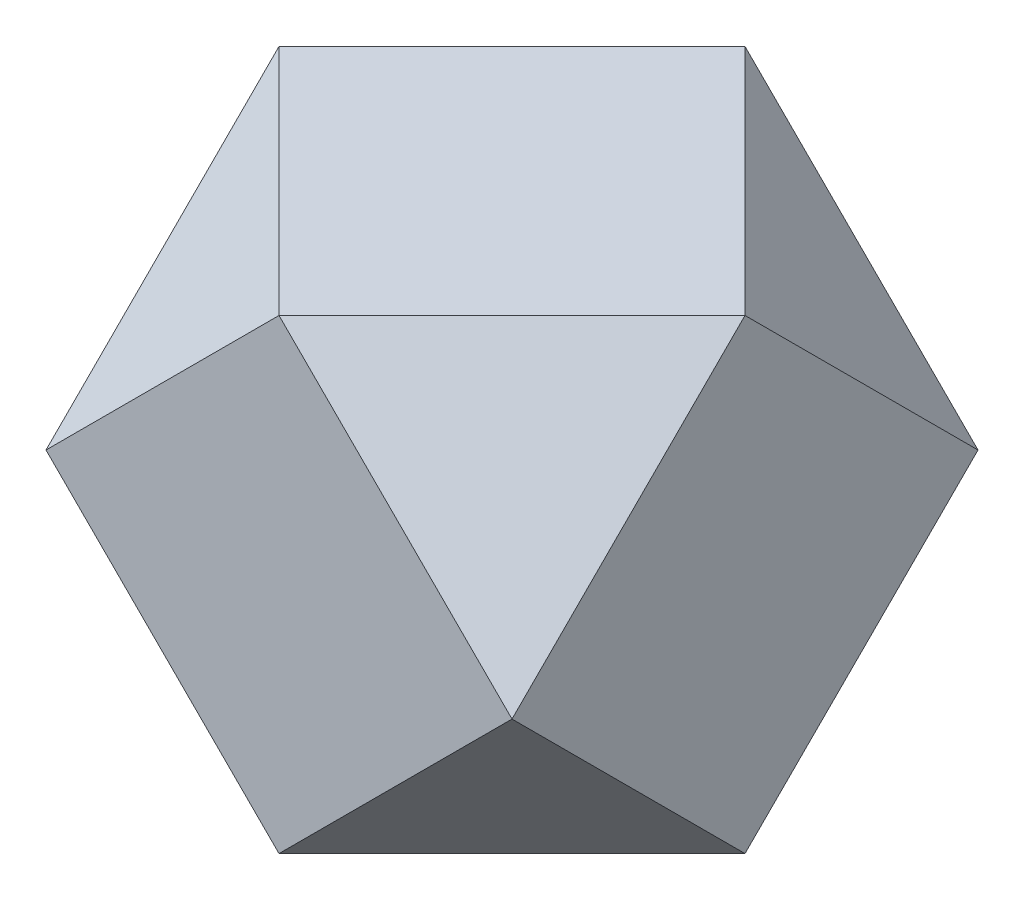
ISO-10303-21;
HEADER;
FILE_DESCRIPTION(('STEP AP214'),'2;1');
FILE_NAME('part.step','',(''),(''),'','','');
FILE_SCHEMA(('AUTOMOTIVE_DESIGN { 1 0 10303 214 1 1 1 1 }'));
ENDSEC;
DATA;
#1=APPLICATION_CONTEXT('core data for automotive mechanical design processes');
#2=APPLICATION_PROTOCOL_DEFINITION('international standard','automotive_design',2000,#1);
#3=PRODUCT_CONTEXT('',#1,'mechanical');
#4=PRODUCT('Part','Part','',(#3));
#5=PRODUCT_RELATED_PRODUCT_CATEGORY('part','',(#4));
#6=PRODUCT_DEFINITION_FORMATION('','',#4);
#7=PRODUCT_DEFINITION_CONTEXT('part definition',#1,'design');
#8=PRODUCT_DEFINITION('design','',#6,#7);
#9=PRODUCT_DEFINITION_SHAPE('','',#8);
#10=(LENGTH_UNIT() NAMED_UNIT(*) SI_UNIT(.MILLI.,.METRE.));
#11=(NAMED_UNIT(*) PLANE_ANGLE_UNIT() SI_UNIT($,.RADIAN.));
#12=(NAMED_UNIT(*) SI_UNIT($,.STERADIAN.) SOLID_ANGLE_UNIT());
#13=UNCERTAINTY_MEASURE_WITH_UNIT(LENGTH_MEASURE(1.E-05),#10,'distance_accuracy_value','');
#14=(GEOMETRIC_REPRESENTATION_CONTEXT(3) GLOBAL_UNCERTAINTY_ASSIGNED_CONTEXT((#13)) GLOBAL_UNIT_ASSIGNED_CONTEXT((#10,
#11,#12)) REPRESENTATION_CONTEXT('',''));
#15=CARTESIAN_POINT('',(0.,0.,0.));
#16=DIRECTION('',(0.,0.,1.));
#17=DIRECTION('',(1.,0.,0.));
#18=AXIS2_PLACEMENT_3D('',#15,#16,#17);
#19=CARTESIAN_POINT('',(0.,0.,50.));
#20=DIRECTION('',(0.,0.,1.));
#21=DIRECTION('',(1.,0.,0.));
#22=AXIS2_PLACEMENT_3D('',#19,#20,#21);
#23=PLANE('',#22);
#24=DIRECTION('',(0.707106781186547,-0.707106781186547,0.));
#25=VECTOR('',#24,1.);
#26=CARTESIAN_POINT('',(25.,25.,50.));
#27=LINE('',#26,#25);
#28=CARTESIAN_POINT('',(0.,50.,50.));
#29=VERTEX_POINT('',#28);
#30=CARTESIAN_POINT('',(50.,0.,50.));
#31=VERTEX_POINT('',#30);
#32=EDGE_CURVE('E140',#29,#31,#27,.T.);
#33=ORIENTED_EDGE('',*,*,#32,.T.);
#34=DIRECTION('',(0.707106781186547,0.707106781186548,0.));
#35=VECTOR('',#34,1.);
#36=CARTESIAN_POINT('',(25.,-25.,50.));
#37=LINE('',#36,#35);
#38=CARTESIAN_POINT('',(100.,50.,50.));
#39=VERTEX_POINT('',#38);
#40=EDGE_CURVE('E131',#31,#39,#37,.T.);
#41=ORIENTED_EDGE('',*,*,#40,.T.);
#42=DIRECTION('',(-0.707106781186548,0.707106781186548,0.));
#43=VECTOR('',#42,1.);
#44=CARTESIAN_POINT('',(75.,75.,50.));
#45=LINE('',#44,#43);
#46=CARTESIAN_POINT('',(50.,100.,50.));
#47=VERTEX_POINT('',#46);
#48=EDGE_CURVE('E149',#39,#47,#45,.T.);
#49=ORIENTED_EDGE('',*,*,#48,.T.);
#50=DIRECTION('',(-0.707106781186547,-0.707106781186548,0.));
#51=VECTOR('',#50,1.);
#52=CARTESIAN_POINT('',(-25.,25.,50.));
#53=LINE('',#52,#51);
#54=EDGE_CURVE('E146',#47,#29,#53,.T.);
#55=ORIENTED_EDGE('',*,*,#54,.T.);
#56=EDGE_LOOP('',(#33,#41,#49,#55));
#57=FACE_BOUND('',#56,.T.);
#58=ADVANCED_FACE('F33',(#57),#23,.T.);
#59=CARTESIAN_POINT('',(0.,100.,50.));
#60=DIRECTION('',(1.,0.,0.));
#61=DIRECTION('',(0.,0.,-1.));
#62=AXIS2_PLACEMENT_3D('',#59,#60,#61);
#63=PLANE('',#62);
#64=DIRECTION('',(0.,0.707106781186547,0.707106781186547));
#65=VECTOR('',#64,1.);
#66=CARTESIAN_POINT('',(0.,125.,25.));
#67=LINE('',#66,#65);
#68=CARTESIAN_POINT('',(0.,50.,-50.));
#69=VERTEX_POINT('',#68);
#70=CARTESIAN_POINT('',(0.,100.,0.));
#71=VERTEX_POINT('',#70);
#72=EDGE_CURVE('E101',#69,#71,#67,.T.);
#73=ORIENTED_EDGE('',*,*,#72,.F.);
#74=DIRECTION('',(0.,0.707106781186547,-0.707106781186547));
#75=VECTOR('',#74,1.);
#76=CARTESIAN_POINT('',(0.,25.,-25.));
#77=LINE('',#76,#75);
#78=CARTESIAN_POINT('',(0.,0.,0.));
#79=VERTEX_POINT('',#78);
#80=EDGE_CURVE('E56',#79,#69,#77,.T.);
#81=ORIENTED_EDGE('',*,*,#80,.F.);
#82=DIRECTION('',(0.,-0.707106781186547,-0.707106781186547));
#83=VECTOR('',#82,1.);
#84=CARTESIAN_POINT('',(0.,75.,75.));
#85=LINE('',#84,#83);
#86=EDGE_CURVE('E137',#29,#79,#85,.T.);
#87=ORIENTED_EDGE('',*,*,#86,.F.);
#88=DIRECTION('',(0.,-0.707106781186547,0.707106781186547));
#89=VECTOR('',#88,1.);
#90=CARTESIAN_POINT('',(0.,75.,25.));
#91=LINE('',#90,#89);
#92=EDGE_CURVE('E103',#71,#29,#91,.T.);
#93=ORIENTED_EDGE('',*,*,#92,.F.);
#94=EDGE_LOOP('',(#73,#81,#87,#93));
#95=FACE_BOUND('',#94,.T.);
#96=ADVANCED_FACE('F35',(#95),#63,.F.);
#97=CARTESIAN_POINT('',(0.,0.,50.));
#98=DIRECTION('',(0.,1.,0.));
#99=DIRECTION('',(0.,0.,1.));
#100=AXIS2_PLACEMENT_3D('',#97,#98,#99);
#101=PLANE('',#100);
#102=DIRECTION('',(-0.707106781186548,0.,0.707106781186548));
#103=VECTOR('',#102,1.);
#104=CARTESIAN_POINT('',(-25.,0.,25.));
#105=LINE('',#104,#103);
#106=CARTESIAN_POINT('',(50.,0.,-50.));
#107=VERTEX_POINT('',#106);
#108=EDGE_CURVE('E89',#107,#79,#105,.T.);
#109=ORIENTED_EDGE('',*,*,#108,.F.);
#110=DIRECTION('',(-0.707106781186547,0.,-0.707106781186548));
#111=VECTOR('',#110,1.);
#112=CARTESIAN_POINT('',(75.,0.,-25.));
#113=LINE('',#112,#111);
#114=CARTESIAN_POINT('',(100.,0.,0.));
#115=VERTEX_POINT('',#114);
#116=EDGE_CURVE('E48',#115,#107,#113,.T.);
#117=ORIENTED_EDGE('',*,*,#116,.F.);
#118=DIRECTION('',(0.707106781186547,0.,-0.707106781186548));
#119=VECTOR('',#118,1.);
#120=CARTESIAN_POINT('',(25.,0.,75.));
#121=LINE('',#120,#119);
#122=EDGE_CURVE('E128',#31,#115,#121,.T.);
#123=ORIENTED_EDGE('',*,*,#122,.F.);
#124=DIRECTION('',(0.707106781186548,0.,0.707106781186548));
#125=VECTOR('',#124,1.);
#126=CARTESIAN_POINT('',(25.,0.,25.));
#127=LINE('',#126,#125);
#128=EDGE_CURVE('E134',#79,#31,#127,.T.);
#129=ORIENTED_EDGE('',*,*,#128,.F.);
#130=EDGE_LOOP('',(#109,#117,#123,#129));
#131=FACE_BOUND('',#130,.T.);
#132=ADVANCED_FACE('F186',(#131),#101,.F.);
#133=CARTESIAN_POINT('',(100.,0.,50.));
#134=DIRECTION('',(-1.,0.,0.));
#135=DIRECTION('',(0.,0.,1.));
#136=AXIS2_PLACEMENT_3D('',#133,#134,#135);
#137=PLANE('',#136);
#138=DIRECTION('',(0.,-0.707106781186547,-0.707106781186548));
#139=VECTOR('',#138,1.);
#140=CARTESIAN_POINT('',(100.,75.,-25.));
#141=LINE('',#140,#139);
#142=CARTESIAN_POINT('',(100.,100.,0.));
#143=VERTEX_POINT('',#142);
#144=CARTESIAN_POINT('',(100.,50.,-50.));
#145=VERTEX_POINT('',#144);
#146=EDGE_CURVE('E97',#143,#145,#141,.T.);
#147=ORIENTED_EDGE('',*,*,#146,.F.);
#148=DIRECTION('',(0.,0.707106781186547,-0.707106781186548));
#149=VECTOR('',#148,1.);
#150=CARTESIAN_POINT('',(100.,25.,75.));
#151=LINE('',#150,#149);
#152=EDGE_CURVE('E155',#39,#143,#151,.T.);
#153=ORIENTED_EDGE('',*,*,#152,.F.);
#154=DIRECTION('',(0.,0.707106781186548,0.707106781186548));
#155=VECTOR('',#154,1.);
#156=CARTESIAN_POINT('',(100.,25.,25.));
#157=LINE('',#156,#155);
#158=EDGE_CURVE('E125',#115,#39,#157,.T.);
#159=ORIENTED_EDGE('',*,*,#158,.F.);
#160=DIRECTION('',(0.,-0.707106781186548,0.707106781186548));
#161=VECTOR('',#160,1.);
#162=CARTESIAN_POINT('',(100.,-25.,25.));
#163=LINE('',#162,#161);
#164=EDGE_CURVE('E121',#145,#115,#163,.T.);
#165=ORIENTED_EDGE('',*,*,#164,.F.);
#166=EDGE_LOOP('',(#147,#153,#159,#165));
#167=FACE_BOUND('',#166,.T.);
#168=ADVANCED_FACE('F166',(#167),#137,.F.);
#169=CARTESIAN_POINT('',(100.,100.,50.));
#170=DIRECTION('',(0.,-1.,0.));
#171=DIRECTION('',(1.,0.,0.));
#172=AXIS2_PLACEMENT_3D('',#169,#170,#171);
#173=PLANE('',#172);
#174=DIRECTION('',(0.707106781186548,0.,-0.707106781186548));
#175=VECTOR('',#174,1.);
#176=CARTESIAN_POINT('',(25.,100.,-25.));
#177=LINE('',#176,#175);
#178=CARTESIAN_POINT('',(50.,100.,-50.));
#179=VERTEX_POINT('',#178);
#180=EDGE_CURVE('E41',#71,#179,#177,.T.);
#181=ORIENTED_EDGE('',*,*,#180,.F.);
#182=DIRECTION('',(-0.707106781186548,0.,-0.707106781186548));
#183=VECTOR('',#182,1.);
#184=CARTESIAN_POINT('',(75.,100.,75.));
#185=LINE('',#184,#183);
#186=EDGE_CURVE('E143',#47,#71,#185,.T.);
#187=ORIENTED_EDGE('',*,*,#186,.F.);
#188=DIRECTION('',(-0.707106781186547,0.,0.707106781186548));
#189=VECTOR('',#188,1.);
#190=CARTESIAN_POINT('',(75.,100.,25.));
#191=LINE('',#190,#189);
#192=EDGE_CURVE('E152',#143,#47,#191,.T.);
#193=ORIENTED_EDGE('',*,*,#192,.F.);
#194=DIRECTION('',(0.707106781186547,0.,0.707106781186548));
#195=VECTOR('',#194,1.);
#196=CARTESIAN_POINT('',(125.,100.,25.));
#197=LINE('',#196,#195);
#198=EDGE_CURVE('E114',#179,#143,#197,.T.);
#199=ORIENTED_EDGE('',*,*,#198,.F.);
#200=EDGE_LOOP('',(#181,#187,#193,#199));
#201=FACE_BOUND('',#200,.T.);
#202=ADVANCED_FACE('F162',(#201),#173,.F.);
#203=CARTESIAN_POINT('',(0.,0.,-50.));
#204=DIRECTION('',(0.,0.,1.));
#205=DIRECTION('',(1.,0.,0.));
#206=AXIS2_PLACEMENT_3D('',#203,#204,#205);
#207=PLANE('',#206);
#208=DIRECTION('',(-0.707106781186547,-0.707106781186548,0.));
#209=VECTOR('',#208,1.);
#210=CARTESIAN_POINT('',(-25.,25.,-50.));
#211=LINE('',#210,#209);
#212=EDGE_CURVE('E11',#179,#69,#211,.T.);
#213=ORIENTED_EDGE('',*,*,#212,.F.);
#214=DIRECTION('',(-0.707106781186548,0.707106781186548,0.));
#215=VECTOR('',#214,1.);
#216=CARTESIAN_POINT('',(75.,75.,-50.));
#217=LINE('',#216,#215);
#218=EDGE_CURVE('E107',#145,#179,#217,.T.);
#219=ORIENTED_EDGE('',*,*,#218,.F.);
#220=DIRECTION('',(0.707106781186547,0.707106781186548,0.));
#221=VECTOR('',#220,1.);
#222=CARTESIAN_POINT('',(25.,-25.,-50.));
#223=LINE('',#222,#221);
#224=EDGE_CURVE('E90',#107,#145,#223,.T.);
#225=ORIENTED_EDGE('',*,*,#224,.F.);
#226=DIRECTION('',(0.707106781186547,-0.707106781186547,0.));
#227=VECTOR('',#226,1.);
#228=CARTESIAN_POINT('',(25.,25.,-50.));
#229=LINE('',#228,#227);
#230=EDGE_CURVE('E88',#69,#107,#229,.T.);
#231=ORIENTED_EDGE('',*,*,#230,.F.);
#232=EDGE_LOOP('',(#213,#219,#225,#231));
#233=FACE_BOUND('',#232,.T.);
#234=ADVANCED_FACE('F94',(#233),#207,.F.);
#235=CARTESIAN_POINT('',(66.6666666666667,66.6666666666667,66.6666666666667));
#236=DIRECTION('',(0.577350269189626,0.577350269189626,0.577350269189626));
#237=DIRECTION('',(-0.707106781186548,0.707106781186548,0.));
#238=AXIS2_PLACEMENT_3D('',#235,#236,#237);
#239=PLANE('',#238);
#240=ORIENTED_EDGE('',*,*,#48,.F.);
#241=ORIENTED_EDGE('',*,*,#152,.T.);
#242=ORIENTED_EDGE('',*,*,#192,.T.);
#243=EDGE_LOOP('',(#240,#241,#242));
#244=FACE_BOUND('',#243,.T.);
#245=ADVANCED_FACE('F160',(#244),#239,.T.);
#246=CARTESIAN_POINT('',(-33.3333333333333,33.3333333333333,33.3333333333333));
#247=DIRECTION('',(-0.577350269189626,0.577350269189626,0.577350269189626));
#248=DIRECTION('',(0.707106781186547,0.,0.707106781186548));
#249=AXIS2_PLACEMENT_3D('',#246,#247,#248);
#250=PLANE('',#249);
#251=ORIENTED_EDGE('',*,*,#54,.F.);
#252=ORIENTED_EDGE('',*,*,#186,.T.);
#253=ORIENTED_EDGE('',*,*,#92,.T.);
#254=EDGE_LOOP('',(#251,#252,#253));
#255=FACE_BOUND('',#254,.T.);
#256=ADVANCED_FACE('F203',(#255),#250,.T.);
#257=CARTESIAN_POINT('',(0.,0.,0.));
#258=DIRECTION('',(-0.577350269189626,-0.577350269189626,0.577350269189626));
#259=DIRECTION('',(0.707106781186547,0.,0.707106781186547));
#260=AXIS2_PLACEMENT_3D('',#257,#258,#259);
#261=PLANE('',#260);
#262=ORIENTED_EDGE('',*,*,#32,.F.);
#263=ORIENTED_EDGE('',*,*,#86,.T.);
#264=ORIENTED_EDGE('',*,*,#128,.T.);
#265=EDGE_LOOP('',(#262,#263,#264));
#266=FACE_BOUND('',#265,.T.);
#267=ADVANCED_FACE('F177',(#266),#261,.T.);
#268=CARTESIAN_POINT('',(33.3333333333333,-33.3333333333333,33.3333333333333));
#269=DIRECTION('',(0.577350269189626,-0.577350269189626,0.577350269189626));
#270=DIRECTION('',(0.707106781186547,0.,-0.707106781186548));
#271=AXIS2_PLACEMENT_3D('',#268,#269,#270);
#272=PLANE('',#271);
#273=ORIENTED_EDGE('',*,*,#40,.F.);
#274=ORIENTED_EDGE('',*,*,#122,.T.);
#275=ORIENTED_EDGE('',*,*,#158,.T.);
#276=EDGE_LOOP('',(#273,#274,#275));
#277=FACE_BOUND('',#276,.T.);
#278=ADVANCED_FACE('F170',(#277),#272,.T.);
#279=CARTESIAN_POINT('',(33.3333333333333,-33.3333333333333,-33.3333333333333));
#280=DIRECTION('',(0.577350269189626,-0.577350269189626,-0.577350269189626));
#281=DIRECTION('',(-0.707106781186547,0.,-0.707106781186548));
#282=AXIS2_PLACEMENT_3D('',#279,#280,#281);
#283=PLANE('',#282);
#284=ORIENTED_EDGE('',*,*,#164,.T.);
#285=ORIENTED_EDGE('',*,*,#116,.T.);
#286=ORIENTED_EDGE('',*,*,#224,.T.);
#287=EDGE_LOOP('',(#284,#285,#286));
#288=FACE_BOUND('',#287,.T.);
#289=ADVANCED_FACE('F168',(#288),#283,.T.);
#290=CARTESIAN_POINT('',(0.,0.,0.));
#291=DIRECTION('',(-0.577350269189626,-0.577350269189626,-0.577350269189626));
#292=DIRECTION('',(-0.707106781186547,0.,0.707106781186547));
#293=AXIS2_PLACEMENT_3D('',#290,#291,#292);
#294=PLANE('',#293);
#295=ORIENTED_EDGE('',*,*,#108,.T.);
#296=ORIENTED_EDGE('',*,*,#80,.T.);
#297=ORIENTED_EDGE('',*,*,#230,.T.);
#298=EDGE_LOOP('',(#295,#296,#297));
#299=FACE_BOUND('',#298,.T.);
#300=ADVANCED_FACE('F87',(#299),#294,.T.);
#301=CARTESIAN_POINT('',(66.6666666666667,66.6666666666667,-66.6666666666667));
#302=DIRECTION('',(0.577350269189626,0.577350269189626,-0.577350269189626));
#303=DIRECTION('',(-0.707106781186548,0.707106781186548,0.));
#304=AXIS2_PLACEMENT_3D('',#301,#302,#303);
#305=PLANE('',#304);
#306=ORIENTED_EDGE('',*,*,#198,.T.);
#307=ORIENTED_EDGE('',*,*,#146,.T.);
#308=ORIENTED_EDGE('',*,*,#218,.T.);
#309=EDGE_LOOP('',(#306,#307,#308));
#310=FACE_BOUND('',#309,.T.);
#311=ADVANCED_FACE('F164',(#310),#305,.T.);
#312=CARTESIAN_POINT('',(-33.3333333333333,33.3333333333333,-33.3333333333333));
#313=DIRECTION('',(-0.577350269189626,0.577350269189626,-0.577350269189626));
#314=DIRECTION('',(-0.707106781186547,0.,0.707106781186548));
#315=AXIS2_PLACEMENT_3D('',#312,#313,#314);
#316=PLANE('',#315);
#317=ORIENTED_EDGE('',*,*,#212,.T.);
#318=ORIENTED_EDGE('',*,*,#72,.T.);
#319=ORIENTED_EDGE('',*,*,#180,.T.);
#320=EDGE_LOOP('',(#317,#318,#319));
#321=FACE_BOUND('',#320,.T.);
#322=ADVANCED_FACE('F109',(#321),#316,.T.);
#323=CLOSED_SHELL('',(#58,#96,#132,#168,#202,#234,#245,#256,#267,#278,#289,#300,#311,#322));
#324=MANIFOLD_SOLID_BREP('B2',#323);
#325=ADVANCED_BREP_SHAPE_REPRESENTATION('',(#18,#324),#14);
#326=SHAPE_DEFINITION_REPRESENTATION(#9,#325);
ENDSEC;
END-ISO-10303-21;
